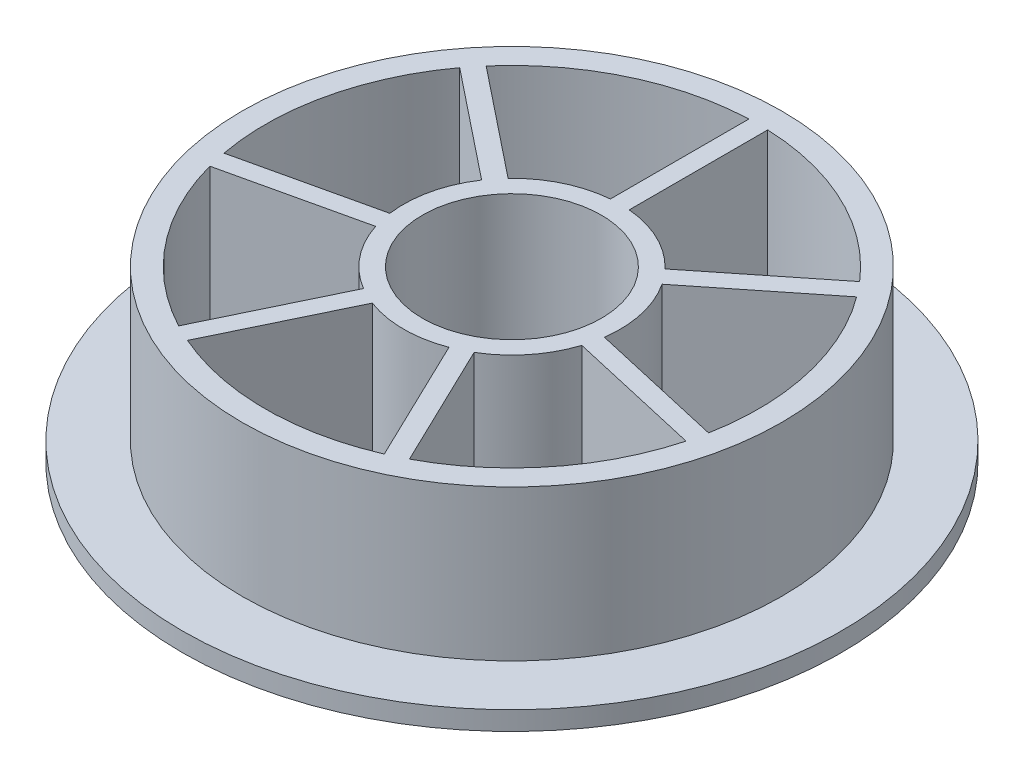
ISO-10303-21;
HEADER;
FILE_DESCRIPTION(('STEP AP214'),'2;1');
FILE_NAME('part.step','',(''),(''),'','','');
FILE_SCHEMA(('AUTOMOTIVE_DESIGN { 1 0 10303 214 1 1 1 1 }'));
ENDSEC;
DATA;
#1=APPLICATION_CONTEXT('core data for automotive mechanical design processes');
#2=APPLICATION_PROTOCOL_DEFINITION('international standard','automotive_design',2000,#1);
#3=PRODUCT_CONTEXT('',#1,'mechanical');
#4=PRODUCT('Part','Part','',(#3));
#5=PRODUCT_RELATED_PRODUCT_CATEGORY('part','',(#4));
#6=PRODUCT_DEFINITION_FORMATION('','',#4);
#7=PRODUCT_DEFINITION_CONTEXT('part definition',#1,'design');
#8=PRODUCT_DEFINITION('design','',#6,#7);
#9=PRODUCT_DEFINITION_SHAPE('','',#8);
#10=(LENGTH_UNIT() NAMED_UNIT(*) SI_UNIT(.MILLI.,.METRE.));
#11=(NAMED_UNIT(*) PLANE_ANGLE_UNIT() SI_UNIT($,.RADIAN.));
#12=(NAMED_UNIT(*) SI_UNIT($,.STERADIAN.) SOLID_ANGLE_UNIT());
#13=UNCERTAINTY_MEASURE_WITH_UNIT(LENGTH_MEASURE(1.E-05),#10,'distance_accuracy_value','');
#14=(GEOMETRIC_REPRESENTATION_CONTEXT(3) GLOBAL_UNCERTAINTY_ASSIGNED_CONTEXT((#13)) GLOBAL_UNIT_ASSIGNED_CONTEXT((#10,
#11,#12)) REPRESENTATION_CONTEXT('',''));
#15=CARTESIAN_POINT('',(0.,0.,0.));
#16=DIRECTION('',(0.,0.,1.));
#17=DIRECTION('',(1.,0.,0.));
#18=AXIS2_PLACEMENT_3D('',#15,#16,#17);
#19=CARTESIAN_POINT('',(0.,18.,0.));
#20=DIRECTION('',(0.,1.,0.));
#21=DIRECTION('',(0.,0.,1.));
#22=AXIS2_PLACEMENT_3D('',#19,#20,#21);
#23=PLANE('',#22);
#24=DIRECTION('',(0.433883739117558,0.,-0.900968867902419));
#25=VECTOR('',#24,1.);
#26=CARTESIAN_POINT('',(-12.2533879154767,18.,23.1396573160315));
#27=LINE('',#26,#25);
#28=CARTESIAN_POINT('',(-12.2533879154767,18.,23.1396573160315));
#29=VERTEX_POINT('',#28);
#30=CARTESIAN_POINT('',(-5.87173156119197,18.,9.88801135078748));
#31=VERTEX_POINT('',#30);
#32=EDGE_CURVE('E229',#29,#31,#27,.T.);
#33=ORIENTED_EDGE('',*,*,#32,.F.);
#34=CARTESIAN_POINT('',(0.,18.,0.));
#35=DIRECTION('',(0.,1.,0.));
#36=DIRECTION('',(0.,0.,1.));
#37=AXIS2_PLACEMENT_3D('',#34,#35,#36);
#38=CIRCLE('',#37,26.1837593960554);
#39=CARTESIAN_POINT('',(-25.2861331188013,18.,6.79711174020116));
#40=VERTEX_POINT('',#39);
#41=EDGE_CURVE('E221',#40,#29,#38,.T.);
#42=ORIENTED_EDGE('',*,*,#41,.F.);
#43=DIRECTION('',(-0.974927912181824,0.,0.222520933956315));
#44=VECTOR('',#43,1.);
#45=CARTESIAN_POINT('',(-25.2861331188013,18.,6.79711174020116));
#46=LINE('',#45,#44);
#47=CARTESIAN_POINT('',(-10.9466814527894,18.,3.52422547110097));
#48=VERTEX_POINT('',#47);
#49=EDGE_CURVE('E244',#48,#40,#46,.T.);
#50=ORIENTED_EDGE('',*,*,#49,.F.);
#51=CARTESIAN_POINT('',(0.,18.,0.));
#52=DIRECTION('',(0.,-1.,0.));
#53=DIRECTION('',(0.,0.,1.));
#54=AXIS2_PLACEMENT_3D('',#51,#52,#53);
#55=CIRCLE('',#54,11.5);
#56=EDGE_CURVE('E242',#31,#48,#55,.T.);
#57=ORIENTED_EDGE('',*,*,#56,.F.);
#58=EDGE_LOOP('',(#33,#42,#50,#57));
#59=FACE_BOUND('',#58,.T.);
#60=DIRECTION('',(-0.974927912181824,0.,-0.222520933956314));
#61=VECTOR('',#60,1.);
#62=CARTESIAN_POINT('',(25.2861331188022,18.,6.79711174019798));
#63=LINE('',#62,#61);
#64=CARTESIAN_POINT('',(25.2861331188022,18.,6.79711174019798));
#65=VERTEX_POINT('',#64);
#66=CARTESIAN_POINT('',(10.9466814527904,18.,3.52422547109784));
#67=VERTEX_POINT('',#66);
#68=EDGE_CURVE('E292',#65,#67,#63,.T.);
#69=ORIENTED_EDGE('',*,*,#68,.F.);
#70=CARTESIAN_POINT('',(0.,18.,0.));
#71=DIRECTION('',(0.,1.,0.));
#72=DIRECTION('',(0.,0.,1.));
#73=AXIS2_PLACEMENT_3D('',#70,#71,#72);
#74=CIRCLE('',#73,26.1837593960554);
#75=CARTESIAN_POINT('',(12.2533879154812,18.,23.1396573160291));
#76=VERTEX_POINT('',#75);
#77=EDGE_CURVE('E290',#76,#65,#74,.T.);
#78=ORIENTED_EDGE('',*,*,#77,.F.);
#79=DIRECTION('',(0.433883739117559,0.,0.900968867902419));
#80=VECTOR('',#79,1.);
#81=CARTESIAN_POINT('',(12.2533879154812,18.,23.1396573160291));
#82=LINE('',#81,#80);
#83=CARTESIAN_POINT('',(5.87173156119638,18.,9.88801135078487));
#84=VERTEX_POINT('',#83);
#85=EDGE_CURVE('E298',#84,#76,#82,.T.);
#86=ORIENTED_EDGE('',*,*,#85,.F.);
#87=CARTESIAN_POINT('',(0.,18.,0.));
#88=DIRECTION('',(0.,-1.,0.));
#89=DIRECTION('',(0.,0.,1.));
#90=AXIS2_PLACEMENT_3D('',#87,#88,#89);
#91=CIRCLE('',#90,11.5);
#92=EDGE_CURVE('E295',#67,#84,#91,.T.);
#93=ORIENTED_EDGE('',*,*,#92,.F.);
#94=EDGE_LOOP('',(#69,#78,#86,#93));
#95=FACE_BOUND('',#94,.T.);
#96=DIRECTION('',(0.78183148246803,0.,-0.623489801858734));
#97=VECTOR('',#96,1.);
#98=CARTESIAN_POINT('',(19.8328624726385,18.,-17.0952280549844));
#99=LINE('',#98,#97);
#100=CARTESIAN_POINT('',(8.33351507091407,18.,-7.92480451259513));
#101=VERTEX_POINT('',#100);
#102=CARTESIAN_POINT('',(19.8328624726385,18.,-17.0952280549844));
#103=VERTEX_POINT('',#102);
#104=EDGE_CURVE('E354',#101,#103,#99,.T.);
#105=ORIENTED_EDGE('',*,*,#104,.F.);
#106=CARTESIAN_POINT('',(0.,18.,0.));
#107=DIRECTION('',(0.,-1.,0.));
#108=DIRECTION('',(0.,0.,1.));
#109=AXIS2_PLACEMENT_3D('',#106,#107,#108);
#110=CIRCLE('',#109,11.5);
#111=CARTESIAN_POINT('',(0.999999999999998,18.,-11.4564392373896));
#112=VERTEX_POINT('',#111);
#113=EDGE_CURVE('E352',#112,#101,#110,.T.);
#114=ORIENTED_EDGE('',*,*,#113,.F.);
#115=DIRECTION('',(0.,0.,1.));
#116=VECTOR('',#115,1.);
#117=CARTESIAN_POINT('',(1.,18.,-26.1646566212997));
#118=LINE('',#117,#116);
#119=CARTESIAN_POINT('',(1.,18.,-26.1646566212997));
#120=VERTEX_POINT('',#119);
#121=EDGE_CURVE('E360',#120,#112,#118,.T.);
#122=ORIENTED_EDGE('',*,*,#121,.F.);
#123=CARTESIAN_POINT('',(0.,18.,0.));
#124=DIRECTION('',(0.,1.,0.));
#125=DIRECTION('',(0.,0.,1.));
#126=AXIS2_PLACEMENT_3D('',#123,#124,#125);
#127=CIRCLE('',#126,26.1837593960554);
#128=EDGE_CURVE('E357',#103,#120,#127,.T.);
#129=ORIENTED_EDGE('',*,*,#128,.F.);
#130=EDGE_LOOP('',(#105,#114,#122,#129));
#131=FACE_BOUND('',#130,.T.);
#132=DIRECTION('',(0.78183148246803,0.,0.623489801858733));
#133=VECTOR('',#132,1.);
#134=CARTESIAN_POINT('',(-19.8328624726392,18.,-17.0952280549837));
#135=LINE('',#134,#133);
#136=CARTESIAN_POINT('',(-19.8328624726392,18.,-17.0952280549837));
#137=VERTEX_POINT('',#136);
#138=CARTESIAN_POINT('',(-8.33351507091476,18.,-7.9248045125944));
#139=VERTEX_POINT('',#138);
#140=EDGE_CURVE('E416',#137,#139,#135,.T.);
#141=ORIENTED_EDGE('',*,*,#140,.F.);
#142=CARTESIAN_POINT('',(0.,18.,0.));
#143=DIRECTION('',(0.,1.,0.));
#144=DIRECTION('',(0.,0.,1.));
#145=AXIS2_PLACEMENT_3D('',#142,#143,#144);
#146=CIRCLE('',#145,26.1837593960554);
#147=CARTESIAN_POINT('',(-1.,18.,-26.1646566212997));
#148=VERTEX_POINT('',#147);
#149=EDGE_CURVE('E414',#148,#137,#146,.T.);
#150=ORIENTED_EDGE('',*,*,#149,.F.);
#151=DIRECTION('',(0.,0.,-1.));
#152=VECTOR('',#151,1.);
#153=CARTESIAN_POINT('',(-1.,18.,-26.1646566212997));
#154=LINE('',#153,#152);
#155=CARTESIAN_POINT('',(-0.999999999999998,18.,-11.4564392373896));
#156=VERTEX_POINT('',#155);
#157=EDGE_CURVE('E422',#156,#148,#154,.T.);
#158=ORIENTED_EDGE('',*,*,#157,.F.);
#159=CARTESIAN_POINT('',(0.,18.,0.));
#160=DIRECTION('',(0.,-1.,0.));
#161=DIRECTION('',(0.,0.,1.));
#162=AXIS2_PLACEMENT_3D('',#159,#160,#161);
#163=CIRCLE('',#162,11.5);
#164=EDGE_CURVE('E419',#139,#156,#163,.T.);
#165=ORIENTED_EDGE('',*,*,#164,.F.);
#166=EDGE_LOOP('',(#141,#150,#158,#165));
#167=FACE_BOUND('',#166,.T.);
#168=CARTESIAN_POINT('',(0.,18.,0.));
#169=DIRECTION('',(0.,1.,0.));
#170=DIRECTION('',(0.,0.,1.));
#171=AXIS2_PLACEMENT_3D('',#168,#169,#170);
#172=CIRCLE('',#171,9.5);
#173=CARTESIAN_POINT('',(0.,18.,9.5));
#174=VERTEX_POINT('',#173);
#175=EDGE_CURVE('E44',#174,#174,#172,.T.);
#176=ORIENTED_EDGE('',*,*,#175,.F.);
#177=EDGE_LOOP('',(#176));
#178=FACE_BOUND('',#177,.T.);
#179=DIRECTION('',(-0.78183148246803,0.,0.623489801858734));
#180=VECTOR('',#179,1.);
#181=CARTESIAN_POINT('',(21.079842076356,18.,-15.5315650900484));
#182=LINE('',#181,#180);
#183=CARTESIAN_POINT('',(21.079842076356,18.,-15.5315650900484));
#184=VERTEX_POINT('',#183);
#185=CARTESIAN_POINT('',(9.58049467463162,18.,-6.36114154765914));
#186=VERTEX_POINT('',#185);
#187=EDGE_CURVE('E385',#184,#186,#182,.T.);
#188=ORIENTED_EDGE('',*,*,#187,.F.);
#189=CARTESIAN_POINT('',(0.,18.,0.));
#190=DIRECTION('',(0.,1.,0.));
#191=DIRECTION('',(0.,0.,1.));
#192=AXIS2_PLACEMENT_3D('',#189,#190,#191);
#193=CIRCLE('',#192,26.1837593960554);
#194=CARTESIAN_POINT('',(25.7311749867147,18.,4.84725591583431));
#195=VERTEX_POINT('',#194);
#196=EDGE_CURVE('E383',#195,#184,#193,.T.);
#197=ORIENTED_EDGE('',*,*,#196,.F.);
#198=DIRECTION('',(0.974927912181824,0.,0.222520933956314));
#199=VECTOR('',#198,1.);
#200=CARTESIAN_POINT('',(25.7311749867147,18.,4.84725591583431));
#201=LINE('',#200,#199);
#202=CARTESIAN_POINT('',(11.3917233207027,18.,1.57436964673412));
#203=VERTEX_POINT('',#202);
#204=EDGE_CURVE('E391',#203,#195,#201,.T.);
#205=ORIENTED_EDGE('',*,*,#204,.F.);
#206=CARTESIAN_POINT('',(0.,18.,0.));
#207=DIRECTION('',(0.,-1.,0.));
#208=DIRECTION('',(0.,0.,1.));
#209=AXIS2_PLACEMENT_3D('',#206,#207,#208);
#210=CIRCLE('',#209,11.5);
#211=EDGE_CURVE('E388',#186,#203,#210,.T.);
#212=ORIENTED_EDGE('',*,*,#211,.F.);
#213=EDGE_LOOP('',(#188,#197,#205,#212));
#214=FACE_BOUND('',#213,.T.);
#215=DIRECTION('',(0.974927912181824,0.,-0.222520933956315));
#216=VECTOR('',#215,1.);
#217=CARTESIAN_POINT('',(-25.731174986714,18.,4.84725591583754));
#218=LINE('',#217,#216);
#219=CARTESIAN_POINT('',(-25.731174986714,18.,4.84725591583754));
#220=VERTEX_POINT('',#219);
#221=CARTESIAN_POINT('',(-11.3917233207023,18.,1.57436964673739));
#222=VERTEX_POINT('',#221);
#223=EDGE_CURVE('E323',#220,#222,#218,.T.);
#224=ORIENTED_EDGE('',*,*,#223,.F.);
#225=CARTESIAN_POINT('',(0.,18.,0.));
#226=DIRECTION('',(0.,1.,0.));
#227=DIRECTION('',(0.,0.,1.));
#228=AXIS2_PLACEMENT_3D('',#225,#226,#227);
#229=CIRCLE('',#228,26.1837593960554);
#230=CARTESIAN_POINT('',(-21.0798420763567,18.,-15.5315650900476));
#231=VERTEX_POINT('',#230);
#232=EDGE_CURVE('E321',#231,#220,#229,.T.);
#233=ORIENTED_EDGE('',*,*,#232,.F.);
#234=DIRECTION('',(-0.78183148246803,0.,-0.623489801858733));
#235=VECTOR('',#234,1.);
#236=CARTESIAN_POINT('',(-21.0798420763567,18.,-15.5315650900476));
#237=LINE('',#236,#235);
#238=CARTESIAN_POINT('',(-9.58049467463218,18.,-6.36114154765829));
#239=VERTEX_POINT('',#238);
#240=EDGE_CURVE('E329',#239,#231,#237,.T.);
#241=ORIENTED_EDGE('',*,*,#240,.F.);
#242=CARTESIAN_POINT('',(0.,18.,0.));
#243=DIRECTION('',(0.,-1.,0.));
#244=DIRECTION('',(0.,0.,1.));
#245=AXIS2_PLACEMENT_3D('',#242,#243,#244);
#246=CIRCLE('',#245,11.5);
#247=EDGE_CURVE('E326',#222,#239,#246,.T.);
#248=ORIENTED_EDGE('',*,*,#247,.F.);
#249=EDGE_LOOP('',(#224,#233,#241,#248));
#250=FACE_BOUND('',#249,.T.);
#251=DIRECTION('',(-0.433883739117558,0.,-0.900968867902419));
#252=VECTOR('',#251,1.);
#253=CARTESIAN_POINT('',(10.4514501796765,18.,24.0074247942644));
#254=LINE('',#253,#252);
#255=CARTESIAN_POINT('',(10.4514501796765,18.,24.0074247942644));
#256=VERTEX_POINT('',#255);
#257=CARTESIAN_POINT('',(4.06979382539173,18.,10.7557788290204));
#258=VERTEX_POINT('',#257);
#259=EDGE_CURVE('E261',#256,#258,#254,.T.);
#260=ORIENTED_EDGE('',*,*,#259,.F.);
#261=CARTESIAN_POINT('',(0.,18.,0.));
#262=DIRECTION('',(0.,1.,0.));
#263=DIRECTION('',(0.,0.,1.));
#264=AXIS2_PLACEMENT_3D('',#261,#262,#263);
#265=CIRCLE('',#264,26.1837593960554);
#266=CARTESIAN_POINT('',(-10.4514501796718,18.,24.0074247942665));
#267=VERTEX_POINT('',#266);
#268=EDGE_CURVE('E259',#267,#256,#265,.T.);
#269=ORIENTED_EDGE('',*,*,#268,.F.);
#270=DIRECTION('',(-0.433883739117558,0.,0.900968867902419));
#271=VECTOR('',#270,1.);
#272=CARTESIAN_POINT('',(-10.4514501796718,18.,24.0074247942665));
#273=LINE('',#272,#271);
#274=CARTESIAN_POINT('',(-4.06979382538694,18.,10.7557788290222));
#275=VERTEX_POINT('',#274);
#276=EDGE_CURVE('E267',#275,#267,#273,.T.);
#277=ORIENTED_EDGE('',*,*,#276,.F.);
#278=CARTESIAN_POINT('',(0.,18.,0.));
#279=DIRECTION('',(0.,-1.,0.));
#280=DIRECTION('',(0.,0.,1.));
#281=AXIS2_PLACEMENT_3D('',#278,#279,#280);
#282=CIRCLE('',#281,11.5);
#283=EDGE_CURVE('E264',#258,#275,#282,.T.);
#284=ORIENTED_EDGE('',*,*,#283,.F.);
#285=EDGE_LOOP('',(#260,#269,#277,#284));
#286=FACE_BOUND('',#285,.T.);
#287=CARTESIAN_POINT('',(0.,18.,0.));
#288=DIRECTION('',(0.,1.,0.));
#289=DIRECTION('',(0.,0.,1.));
#290=AXIS2_PLACEMENT_3D('',#287,#288,#289);
#291=CIRCLE('',#290,28.6507379536552);
#292=CARTESIAN_POINT('',(0.,18.,28.6507379536552));
#293=VERTEX_POINT('',#292);
#294=EDGE_CURVE('E481',#293,#293,#291,.T.);
#295=ORIENTED_EDGE('',*,*,#294,.T.);
#296=EDGE_LOOP('',(#295));
#297=FACE_BOUND('',#296,.T.);
#298=ADVANCED_FACE('F35',(#59,#95,#131,#167,#178,#214,#250,#286,#297),#23,.T.);
#299=CARTESIAN_POINT('',(0.,18.,0.));
#300=DIRECTION('',(0.,-1.,0.));
#301=DIRECTION('',(0.,0.,-1.));
#302=AXIS2_PLACEMENT_3D('',#299,#300,#301);
#303=CYLINDRICAL_SURFACE('',#302,35.);
#304=CARTESIAN_POINT('',(0.,0.,0.));
#305=DIRECTION('',(0.,1.,0.));
#306=DIRECTION('',(0.,0.,1.));
#307=AXIS2_PLACEMENT_3D('',#304,#305,#306);
#308=CIRCLE('',#307,35.);
#309=CARTESIAN_POINT('',(0.,0.,35.));
#310=VERTEX_POINT('',#309);
#311=EDGE_CURVE('E11',#310,#310,#308,.T.);
#312=ORIENTED_EDGE('',*,*,#311,.T.);
#313=EDGE_LOOP('',(#312));
#314=FACE_BOUND('',#313,.T.);
#315=CARTESIAN_POINT('',(0.,2.,0.));
#316=DIRECTION('',(0.,1.,0.));
#317=DIRECTION('',(0.,0.,1.));
#318=AXIS2_PLACEMENT_3D('',#315,#316,#317);
#319=CIRCLE('',#318,35.);
#320=CARTESIAN_POINT('',(0.,2.,35.));
#321=VERTEX_POINT('',#320);
#322=EDGE_CURVE('E39',#321,#321,#319,.T.);
#323=ORIENTED_EDGE('',*,*,#322,.F.);
#324=EDGE_LOOP('',(#323));
#325=FACE_BOUND('',#324,.T.);
#326=ADVANCED_FACE('F37',(#314,#325),#303,.T.);
#327=CARTESIAN_POINT('',(0.,0.,0.));
#328=DIRECTION('',(0.,1.,0.));
#329=DIRECTION('',(0.,0.,1.));
#330=AXIS2_PLACEMENT_3D('',#327,#328,#329);
#331=PLANE('',#330);
#332=CARTESIAN_POINT('',(0.,0.,0.));
#333=DIRECTION('',(0.,1.,0.));
#334=DIRECTION('',(0.,0.,1.));
#335=AXIS2_PLACEMENT_3D('',#332,#333,#334);
#336=CIRCLE('',#335,26.1837593960554);
#337=CARTESIAN_POINT('',(-10.4514501796718,0.,24.0074247942665));
#338=VERTEX_POINT('',#337);
#339=CARTESIAN_POINT('',(10.4514501796765,0.,24.0074247942644));
#340=VERTEX_POINT('',#339);
#341=EDGE_CURVE('E237',#338,#340,#336,.T.);
#342=ORIENTED_EDGE('',*,*,#341,.T.);
#343=DIRECTION('',(-0.433883739117558,0.,-0.900968867902419));
#344=VECTOR('',#343,1.);
#345=CARTESIAN_POINT('',(10.4514501796765,0.,24.0074247942644));
#346=LINE('',#345,#344);
#347=CARTESIAN_POINT('',(4.06979382539173,0.,10.7557788290204));
#348=VERTEX_POINT('',#347);
#349=EDGE_CURVE('E272',#340,#348,#346,.T.);
#350=ORIENTED_EDGE('',*,*,#349,.T.);
#351=CARTESIAN_POINT('',(0.,0.,0.));
#352=DIRECTION('',(0.,-1.,0.));
#353=DIRECTION('',(0.,0.,1.));
#354=AXIS2_PLACEMENT_3D('',#351,#352,#353);
#355=CIRCLE('',#354,11.5);
#356=CARTESIAN_POINT('',(-4.06979382538695,0.,10.7557788290222));
#357=VERTEX_POINT('',#356);
#358=EDGE_CURVE('E275',#348,#357,#355,.T.);
#359=ORIENTED_EDGE('',*,*,#358,.T.);
#360=DIRECTION('',(-0.433883739117558,0.,0.900968867902419));
#361=VECTOR('',#360,1.);
#362=CARTESIAN_POINT('',(-10.4514501796718,0.,24.0074247942665));
#363=LINE('',#362,#361);
#364=EDGE_CURVE('E262',#357,#338,#363,.T.);
#365=ORIENTED_EDGE('',*,*,#364,.T.);
#366=EDGE_LOOP('',(#342,#350,#359,#365));
#367=FACE_BOUND('',#366,.T.);
#368=CARTESIAN_POINT('',(0.,0.,0.));
#369=DIRECTION('',(0.,1.,0.));
#370=DIRECTION('',(0.,0.,1.));
#371=AXIS2_PLACEMENT_3D('',#368,#369,#370);
#372=CIRCLE('',#371,26.1837593960554);
#373=CARTESIAN_POINT('',(-21.0798420763567,0.,-15.5315650900476));
#374=VERTEX_POINT('',#373);
#375=CARTESIAN_POINT('',(-25.731174986714,0.,4.84725591583754));
#376=VERTEX_POINT('',#375);
#377=EDGE_CURVE('E320',#374,#376,#372,.T.);
#378=ORIENTED_EDGE('',*,*,#377,.T.);
#379=DIRECTION('',(0.974927912181824,0.,-0.222520933956315));
#380=VECTOR('',#379,1.);
#381=CARTESIAN_POINT('',(-25.731174986714,0.,4.84725591583754));
#382=LINE('',#381,#380);
#383=CARTESIAN_POINT('',(-11.3917233207023,0.,1.57436964673739));
#384=VERTEX_POINT('',#383);
#385=EDGE_CURVE('E334',#376,#384,#382,.T.);
#386=ORIENTED_EDGE('',*,*,#385,.T.);
#387=CARTESIAN_POINT('',(0.,0.,0.));
#388=DIRECTION('',(0.,-1.,0.));
#389=DIRECTION('',(0.,0.,1.));
#390=AXIS2_PLACEMENT_3D('',#387,#388,#389);
#391=CIRCLE('',#390,11.5);
#392=CARTESIAN_POINT('',(-9.58049467463218,0.,-6.36114154765829));
#393=VERTEX_POINT('',#392);
#394=EDGE_CURVE('E337',#384,#393,#391,.T.);
#395=ORIENTED_EDGE('',*,*,#394,.T.);
#396=DIRECTION('',(-0.78183148246803,0.,-0.623489801858733));
#397=VECTOR('',#396,1.);
#398=CARTESIAN_POINT('',(-21.0798420763567,0.,-15.5315650900476));
#399=LINE('',#398,#397);
#400=EDGE_CURVE('E324',#393,#374,#399,.T.);
#401=ORIENTED_EDGE('',*,*,#400,.T.);
#402=EDGE_LOOP('',(#378,#386,#395,#401));
#403=FACE_BOUND('',#402,.T.);
#404=CARTESIAN_POINT('',(0.,0.,0.));
#405=DIRECTION('',(0.,1.,0.));
#406=DIRECTION('',(0.,0.,1.));
#407=AXIS2_PLACEMENT_3D('',#404,#405,#406);
#408=CIRCLE('',#407,26.1837593960554);
#409=CARTESIAN_POINT('',(25.7311749867147,0.,4.84725591583431));
#410=VERTEX_POINT('',#409);
#411=CARTESIAN_POINT('',(21.079842076356,0.,-15.5315650900484));
#412=VERTEX_POINT('',#411);
#413=EDGE_CURVE('E382',#410,#412,#408,.T.);
#414=ORIENTED_EDGE('',*,*,#413,.T.);
#415=DIRECTION('',(-0.78183148246803,0.,0.623489801858734));
#416=VECTOR('',#415,1.);
#417=CARTESIAN_POINT('',(21.079842076356,0.,-15.5315650900484));
#418=LINE('',#417,#416);
#419=CARTESIAN_POINT('',(9.58049467463162,0.,-6.36114154765914));
#420=VERTEX_POINT('',#419);
#421=EDGE_CURVE('E396',#412,#420,#418,.T.);
#422=ORIENTED_EDGE('',*,*,#421,.T.);
#423=CARTESIAN_POINT('',(0.,0.,0.));
#424=DIRECTION('',(0.,-1.,0.));
#425=DIRECTION('',(0.,0.,1.));
#426=AXIS2_PLACEMENT_3D('',#423,#424,#425);
#427=CIRCLE('',#426,11.5);
#428=CARTESIAN_POINT('',(11.3917233207027,0.,1.57436964673412));
#429=VERTEX_POINT('',#428);
#430=EDGE_CURVE('E399',#420,#429,#427,.T.);
#431=ORIENTED_EDGE('',*,*,#430,.T.);
#432=DIRECTION('',(0.974927912181824,0.,0.222520933956314));
#433=VECTOR('',#432,1.);
#434=CARTESIAN_POINT('',(25.7311749867147,0.,4.84725591583431));
#435=LINE('',#434,#433);
#436=EDGE_CURVE('E386',#429,#410,#435,.T.);
#437=ORIENTED_EDGE('',*,*,#436,.T.);
#438=EDGE_LOOP('',(#414,#422,#431,#437));
#439=FACE_BOUND('',#438,.T.);
#440=CARTESIAN_POINT('',(0.,0.,0.));
#441=DIRECTION('',(0.,1.,0.));
#442=DIRECTION('',(0.,0.,1.));
#443=AXIS2_PLACEMENT_3D('',#440,#441,#442);
#444=CIRCLE('',#443,9.5);
#445=CARTESIAN_POINT('',(0.,0.,9.5));
#446=VERTEX_POINT('',#445);
#447=EDGE_CURVE('E444',#446,#446,#444,.T.);
#448=ORIENTED_EDGE('',*,*,#447,.T.);
#449=EDGE_LOOP('',(#448));
#450=FACE_BOUND('',#449,.T.);
#451=ORIENTED_EDGE('',*,*,#311,.F.);
#452=EDGE_LOOP('',(#451));
#453=FACE_BOUND('',#452,.T.);
#454=CARTESIAN_POINT('',(0.,0.,0.));
#455=DIRECTION('',(0.,1.,0.));
#456=DIRECTION('',(0.,0.,1.));
#457=AXIS2_PLACEMENT_3D('',#454,#455,#456);
#458=CIRCLE('',#457,26.1837593960554);
#459=CARTESIAN_POINT('',(-1.,0.,-26.1646566212997));
#460=VERTEX_POINT('',#459);
#461=CARTESIAN_POINT('',(-19.8328624726392,0.,-17.0952280549837));
#462=VERTEX_POINT('',#461);
#463=EDGE_CURVE('E413',#460,#462,#458,.T.);
#464=ORIENTED_EDGE('',*,*,#463,.T.);
#465=DIRECTION('',(0.78183148246803,0.,0.623489801858733));
#466=VECTOR('',#465,1.);
#467=CARTESIAN_POINT('',(-19.8328624726392,0.,-17.0952280549837));
#468=LINE('',#467,#466);
#469=CARTESIAN_POINT('',(-8.33351507091476,0.,-7.9248045125944));
#470=VERTEX_POINT('',#469);
#471=EDGE_CURVE('E427',#462,#470,#468,.T.);
#472=ORIENTED_EDGE('',*,*,#471,.T.);
#473=CARTESIAN_POINT('',(0.,0.,0.));
#474=DIRECTION('',(0.,-1.,0.));
#475=DIRECTION('',(0.,0.,1.));
#476=AXIS2_PLACEMENT_3D('',#473,#474,#475);
#477=CIRCLE('',#476,11.5);
#478=CARTESIAN_POINT('',(-0.999999999999998,0.,-11.4564392373896));
#479=VERTEX_POINT('',#478);
#480=EDGE_CURVE('E430',#470,#479,#477,.T.);
#481=ORIENTED_EDGE('',*,*,#480,.T.);
#482=DIRECTION('',(0.,0.,-1.));
#483=VECTOR('',#482,1.);
#484=CARTESIAN_POINT('',(-1.,0.,-26.1646566212997));
#485=LINE('',#484,#483);
#486=EDGE_CURVE('E417',#479,#460,#485,.T.);
#487=ORIENTED_EDGE('',*,*,#486,.T.);
#488=EDGE_LOOP('',(#464,#472,#481,#487));
#489=FACE_BOUND('',#488,.T.);
#490=CARTESIAN_POINT('',(0.,0.,0.));
#491=DIRECTION('',(0.,-1.,0.));
#492=DIRECTION('',(0.,0.,1.));
#493=AXIS2_PLACEMENT_3D('',#490,#491,#492);
#494=CIRCLE('',#493,11.5);
#495=CARTESIAN_POINT('',(0.999999999999998,0.,-11.4564392373896));
#496=VERTEX_POINT('',#495);
#497=CARTESIAN_POINT('',(8.33351507091407,0.,-7.92480451259513));
#498=VERTEX_POINT('',#497);
#499=EDGE_CURVE('E351',#496,#498,#494,.T.);
#500=ORIENTED_EDGE('',*,*,#499,.T.);
#501=DIRECTION('',(0.78183148246803,0.,-0.623489801858734));
#502=VECTOR('',#501,1.);
#503=CARTESIAN_POINT('',(19.8328624726385,0.,-17.0952280549844));
#504=LINE('',#503,#502);
#505=CARTESIAN_POINT('',(19.8328624726385,0.,-17.0952280549844));
#506=VERTEX_POINT('',#505);
#507=EDGE_CURVE('E365',#498,#506,#504,.T.);
#508=ORIENTED_EDGE('',*,*,#507,.T.);
#509=CARTESIAN_POINT('',(0.,0.,0.));
#510=DIRECTION('',(0.,1.,0.));
#511=DIRECTION('',(0.,0.,1.));
#512=AXIS2_PLACEMENT_3D('',#509,#510,#511);
#513=CIRCLE('',#512,26.1837593960554);
#514=CARTESIAN_POINT('',(1.00000000000001,0.,-26.1646566212997));
#515=VERTEX_POINT('',#514);
#516=EDGE_CURVE('E368',#506,#515,#513,.T.);
#517=ORIENTED_EDGE('',*,*,#516,.T.);
#518=DIRECTION('',(0.,0.,1.));
#519=VECTOR('',#518,1.);
#520=CARTESIAN_POINT('',(1.,0.,-26.1646566212997));
#521=LINE('',#520,#519);
#522=EDGE_CURVE('E355',#515,#496,#521,.T.);
#523=ORIENTED_EDGE('',*,*,#522,.T.);
#524=EDGE_LOOP('',(#500,#508,#517,#523));
#525=FACE_BOUND('',#524,.T.);
#526=CARTESIAN_POINT('',(0.,0.,0.));
#527=DIRECTION('',(0.,1.,0.));
#528=DIRECTION('',(0.,0.,1.));
#529=AXIS2_PLACEMENT_3D('',#526,#527,#528);
#530=CIRCLE('',#529,26.1837593960554);
#531=CARTESIAN_POINT('',(12.2533879154812,0.,23.1396573160291));
#532=VERTEX_POINT('',#531);
#533=CARTESIAN_POINT('',(25.2861331188022,0.,6.79711174019798));
#534=VERTEX_POINT('',#533);
#535=EDGE_CURVE('E289',#532,#534,#530,.T.);
#536=ORIENTED_EDGE('',*,*,#535,.T.);
#537=DIRECTION('',(-0.974927912181824,0.,-0.222520933956314));
#538=VECTOR('',#537,1.);
#539=CARTESIAN_POINT('',(25.2861331188022,0.,6.79711174019798));
#540=LINE('',#539,#538);
#541=CARTESIAN_POINT('',(10.9466814527904,0.,3.52422547109784));
#542=VERTEX_POINT('',#541);
#543=EDGE_CURVE('E303',#534,#542,#540,.T.);
#544=ORIENTED_EDGE('',*,*,#543,.T.);
#545=CARTESIAN_POINT('',(0.,0.,0.));
#546=DIRECTION('',(0.,-1.,0.));
#547=DIRECTION('',(0.,0.,1.));
#548=AXIS2_PLACEMENT_3D('',#545,#546,#547);
#549=CIRCLE('',#548,11.5);
#550=CARTESIAN_POINT('',(5.87173156119638,0.,9.88801135078487));
#551=VERTEX_POINT('',#550);
#552=EDGE_CURVE('E306',#542,#551,#549,.T.);
#553=ORIENTED_EDGE('',*,*,#552,.T.);
#554=DIRECTION('',(0.433883739117559,0.,0.900968867902419));
#555=VECTOR('',#554,1.);
#556=CARTESIAN_POINT('',(12.2533879154812,0.,23.1396573160291));
#557=LINE('',#556,#555);
#558=EDGE_CURVE('E293',#551,#532,#557,.T.);
#559=ORIENTED_EDGE('',*,*,#558,.T.);
#560=EDGE_LOOP('',(#536,#544,#553,#559));
#561=FACE_BOUND('',#560,.T.);
#562=CARTESIAN_POINT('',(0.,0.,0.));
#563=DIRECTION('',(0.,1.,0.));
#564=DIRECTION('',(0.,0.,1.));
#565=AXIS2_PLACEMENT_3D('',#562,#563,#564);
#566=CIRCLE('',#565,26.1837593960554);
#567=CARTESIAN_POINT('',(-25.2861331188013,0.,6.79711174020116));
#568=VERTEX_POINT('',#567);
#569=CARTESIAN_POINT('',(-12.2533879154767,0.,23.1396573160315));
#570=VERTEX_POINT('',#569);
#571=EDGE_CURVE('E59',#568,#570,#566,.T.);
#572=ORIENTED_EDGE('',*,*,#571,.T.);
#573=DIRECTION('',(0.433883739117558,0.,-0.900968867902419));
#574=VECTOR('',#573,1.);
#575=CARTESIAN_POINT('',(-12.2533879154767,0.,23.1396573160315));
#576=LINE('',#575,#574);
#577=CARTESIAN_POINT('',(-5.87173156119197,0.,9.88801135078748));
#578=VERTEX_POINT('',#577);
#579=EDGE_CURVE('E236',#570,#578,#576,.T.);
#580=ORIENTED_EDGE('',*,*,#579,.T.);
#581=CARTESIAN_POINT('',(0.,0.,0.));
#582=DIRECTION('',(0.,-1.,0.));
#583=DIRECTION('',(0.,0.,1.));
#584=AXIS2_PLACEMENT_3D('',#581,#582,#583);
#585=CIRCLE('',#584,11.5);
#586=CARTESIAN_POINT('',(-10.9466814527894,0.,3.52422547110097));
#587=VERTEX_POINT('',#586);
#588=EDGE_CURVE('E251',#578,#587,#585,.T.);
#589=ORIENTED_EDGE('',*,*,#588,.T.);
#590=DIRECTION('',(-0.974927912181824,0.,0.222520933956315));
#591=VECTOR('',#590,1.);
#592=CARTESIAN_POINT('',(-25.2861331188013,0.,6.79711174020116));
#593=LINE('',#592,#591);
#594=EDGE_CURVE('E230',#587,#568,#593,.T.);
#595=ORIENTED_EDGE('',*,*,#594,.T.);
#596=EDGE_LOOP('',(#572,#580,#589,#595));
#597=FACE_BOUND('',#596,.T.);
#598=ADVANCED_FACE('F450',(#367,#403,#439,#450,#453,#489,#525,#561,#597),#331,.F.);
#599=CARTESIAN_POINT('',(0.,18.,0.));
#600=DIRECTION('',(0.,-1.,0.));
#601=DIRECTION('',(0.,0.,-1.));
#602=AXIS2_PLACEMENT_3D('',#599,#600,#601);
#603=CYLINDRICAL_SURFACE('',#602,9.5);
#604=ORIENTED_EDGE('',*,*,#175,.T.);
#605=EDGE_LOOP('',(#604));
#606=FACE_BOUND('',#605,.T.);
#607=ORIENTED_EDGE('',*,*,#447,.F.);
#608=EDGE_LOOP('',(#607));
#609=FACE_BOUND('',#608,.T.);
#610=ADVANCED_FACE('F453',(#606,#609),#603,.F.);
#611=CARTESIAN_POINT('',(0.,18.,0.));
#612=DIRECTION('',(0.,-1.,0.));
#613=DIRECTION('',(0.,0.,-1.));
#614=AXIS2_PLACEMENT_3D('',#611,#612,#613);
#615=CYLINDRICAL_SURFACE('',#614,26.1837593960554);
#616=ORIENTED_EDGE('',*,*,#463,.F.);
#617=DIRECTION('',(0.,-1.,0.));
#618=VECTOR('',#617,1.);
#619=CARTESIAN_POINT('',(-1.,18.,-26.1646566212997));
#620=LINE('',#619,#618);
#621=EDGE_CURVE('E424',#148,#460,#620,.T.);
#622=ORIENTED_EDGE('',*,*,#621,.F.);
#623=ORIENTED_EDGE('',*,*,#149,.T.);
#624=DIRECTION('',(0.,-1.,0.));
#625=VECTOR('',#624,1.);
#626=CARTESIAN_POINT('',(-19.8328624726392,18.,-17.0952280549837));
#627=LINE('',#626,#625);
#628=EDGE_CURVE('E441',#137,#462,#627,.T.);
#629=ORIENTED_EDGE('',*,*,#628,.T.);
#630=EDGE_LOOP('',(#616,#622,#623,#629));
#631=FACE_BOUND('',#630,.T.);
#632=ADVANCED_FACE('F455',(#631),#615,.F.);
#633=CARTESIAN_POINT('',(-19.8328624726392,18.,-17.0952280549837));
#634=DIRECTION('',(0.623489801858733,0.,-0.78183148246803));
#635=DIRECTION('',(-0.78183148246803,0.,-0.623489801858734));
#636=AXIS2_PLACEMENT_3D('',#633,#634,#635);
#637=PLANE('',#636);
#638=ORIENTED_EDGE('',*,*,#471,.F.);
#639=ORIENTED_EDGE('',*,*,#628,.F.);
#640=ORIENTED_EDGE('',*,*,#140,.T.);
#641=DIRECTION('',(0.,-1.,0.));
#642=VECTOR('',#641,1.);
#643=CARTESIAN_POINT('',(-8.33351507091476,18.,-7.9248045125944));
#644=LINE('',#643,#642);
#645=EDGE_CURVE('E439',#139,#470,#644,.T.);
#646=ORIENTED_EDGE('',*,*,#645,.T.);
#647=EDGE_LOOP('',(#638,#639,#640,#646));
#648=FACE_BOUND('',#647,.T.);
#649=ADVANCED_FACE('F462',(#648),#637,.T.);
#650=CARTESIAN_POINT('',(0.,18.,0.));
#651=DIRECTION('',(0.,-1.,0.));
#652=DIRECTION('',(0.,0.,-1.));
#653=AXIS2_PLACEMENT_3D('',#650,#651,#652);
#654=CYLINDRICAL_SURFACE('',#653,11.5);
#655=ORIENTED_EDGE('',*,*,#480,.F.);
#656=ORIENTED_EDGE('',*,*,#645,.F.);
#657=ORIENTED_EDGE('',*,*,#164,.T.);
#658=DIRECTION('',(0.,-1.,0.));
#659=VECTOR('',#658,1.);
#660=CARTESIAN_POINT('',(-0.999999999999998,18.,-11.4564392373896));
#661=LINE('',#660,#659);
#662=EDGE_CURVE('E437',#156,#479,#661,.T.);
#663=ORIENTED_EDGE('',*,*,#662,.T.);
#664=EDGE_LOOP('',(#655,#656,#657,#663));
#665=FACE_BOUND('',#664,.T.);
#666=ADVANCED_FACE('F593',(#665),#654,.T.);
#667=CARTESIAN_POINT('',(-1.,18.,-26.1646566212997));
#668=DIRECTION('',(-1.,0.,0.));
#669=DIRECTION('',(0.,0.,1.));
#670=AXIS2_PLACEMENT_3D('',#667,#668,#669);
#671=PLANE('',#670);
#672=ORIENTED_EDGE('',*,*,#486,.F.);
#673=ORIENTED_EDGE('',*,*,#662,.F.);
#674=ORIENTED_EDGE('',*,*,#157,.T.);
#675=ORIENTED_EDGE('',*,*,#621,.T.);
#676=EDGE_LOOP('',(#672,#673,#674,#675));
#677=FACE_BOUND('',#676,.T.);
#678=ADVANCED_FACE('F589',(#677),#671,.T.);
#679=CARTESIAN_POINT('',(0.,18.,0.));
#680=DIRECTION('',(0.,-1.,0.));
#681=DIRECTION('',(0.,0.,-1.));
#682=AXIS2_PLACEMENT_3D('',#679,#680,#681);
#683=CYLINDRICAL_SURFACE('',#682,26.1837593960554);
#684=ORIENTED_EDGE('',*,*,#413,.F.);
#685=DIRECTION('',(0.,-1.,0.));
#686=VECTOR('',#685,1.);
#687=CARTESIAN_POINT('',(25.7311749867147,18.,4.84725591583431));
#688=LINE('',#687,#686);
#689=EDGE_CURVE('E393',#195,#410,#688,.T.);
#690=ORIENTED_EDGE('',*,*,#689,.F.);
#691=ORIENTED_EDGE('',*,*,#196,.T.);
#692=DIRECTION('',(0.,-1.,0.));
#693=VECTOR('',#692,1.);
#694=CARTESIAN_POINT('',(21.079842076356,18.,-15.5315650900484));
#695=LINE('',#694,#693);
#696=EDGE_CURVE('E410',#184,#412,#695,.T.);
#697=ORIENTED_EDGE('',*,*,#696,.T.);
#698=EDGE_LOOP('',(#684,#690,#691,#697));
#699=FACE_BOUND('',#698,.T.);
#700=ADVANCED_FACE('F585',(#699),#683,.F.);
#701=CARTESIAN_POINT('',(21.079842076356,18.,-15.5315650900484));
#702=DIRECTION('',(0.623489801858734,0.,0.78183148246803));
#703=DIRECTION('',(0.78183148246803,0.,-0.623489801858734));
#704=AXIS2_PLACEMENT_3D('',#701,#702,#703);
#705=PLANE('',#704);
#706=ORIENTED_EDGE('',*,*,#421,.F.);
#707=ORIENTED_EDGE('',*,*,#696,.F.);
#708=ORIENTED_EDGE('',*,*,#187,.T.);
#709=DIRECTION('',(0.,-1.,0.));
#710=VECTOR('',#709,1.);
#711=CARTESIAN_POINT('',(9.58049467463162,18.,-6.36114154765914));
#712=LINE('',#711,#710);
#713=EDGE_CURVE('E408',#186,#420,#712,.T.);
#714=ORIENTED_EDGE('',*,*,#713,.T.);
#715=EDGE_LOOP('',(#706,#707,#708,#714));
#716=FACE_BOUND('',#715,.T.);
#717=ADVANCED_FACE('F581',(#716),#705,.T.);
#718=CARTESIAN_POINT('',(0.,18.,0.));
#719=DIRECTION('',(0.,-1.,0.));
#720=DIRECTION('',(0.,0.,-1.));
#721=AXIS2_PLACEMENT_3D('',#718,#719,#720);
#722=CYLINDRICAL_SURFACE('',#721,11.5);
#723=ORIENTED_EDGE('',*,*,#430,.F.);
#724=ORIENTED_EDGE('',*,*,#713,.F.);
#725=ORIENTED_EDGE('',*,*,#211,.T.);
#726=DIRECTION('',(0.,-1.,0.));
#727=VECTOR('',#726,1.);
#728=CARTESIAN_POINT('',(11.3917233207027,18.,1.57436964673412));
#729=LINE('',#728,#727);
#730=EDGE_CURVE('E406',#203,#429,#729,.T.);
#731=ORIENTED_EDGE('',*,*,#730,.T.);
#732=EDGE_LOOP('',(#723,#724,#725,#731));
#733=FACE_BOUND('',#732,.T.);
#734=ADVANCED_FACE('F577',(#733),#722,.T.);
#735=CARTESIAN_POINT('',(25.7311749867147,18.,4.84725591583431));
#736=DIRECTION('',(0.222520933956314,0.,-0.974927912181824));
#737=DIRECTION('',(-0.974927912181824,0.,-0.222520933956314));
#738=AXIS2_PLACEMENT_3D('',#735,#736,#737);
#739=PLANE('',#738);
#740=ORIENTED_EDGE('',*,*,#436,.F.);
#741=ORIENTED_EDGE('',*,*,#730,.F.);
#742=ORIENTED_EDGE('',*,*,#204,.T.);
#743=ORIENTED_EDGE('',*,*,#689,.T.);
#744=EDGE_LOOP('',(#740,#741,#742,#743));
#745=FACE_BOUND('',#744,.T.);
#746=ADVANCED_FACE('F573',(#745),#739,.T.);
#747=CARTESIAN_POINT('',(0.,18.,0.));
#748=DIRECTION('',(0.,-1.,0.));
#749=DIRECTION('',(0.,0.,-1.));
#750=AXIS2_PLACEMENT_3D('',#747,#748,#749);
#751=CYLINDRICAL_SURFACE('',#750,11.5);
#752=ORIENTED_EDGE('',*,*,#499,.F.);
#753=DIRECTION('',(0.,-1.,0.));
#754=VECTOR('',#753,1.);
#755=CARTESIAN_POINT('',(0.999999999999998,18.,-11.4564392373896));
#756=LINE('',#755,#754);
#757=EDGE_CURVE('E362',#112,#496,#756,.T.);
#758=ORIENTED_EDGE('',*,*,#757,.F.);
#759=ORIENTED_EDGE('',*,*,#113,.T.);
#760=DIRECTION('',(0.,-1.,0.));
#761=VECTOR('',#760,1.);
#762=CARTESIAN_POINT('',(8.33351507091407,18.,-7.92480451259513));
#763=LINE('',#762,#761);
#764=EDGE_CURVE('E379',#101,#498,#763,.T.);
#765=ORIENTED_EDGE('',*,*,#764,.T.);
#766=EDGE_LOOP('',(#752,#758,#759,#765));
#767=FACE_BOUND('',#766,.T.);
#768=ADVANCED_FACE('F569',(#767),#751,.T.);
#769=CARTESIAN_POINT('',(19.8328624726385,18.,-17.0952280549844));
#770=DIRECTION('',(-0.623489801858734,0.,-0.78183148246803));
#771=DIRECTION('',(-0.78183148246803,0.,0.623489801858734));
#772=AXIS2_PLACEMENT_3D('',#769,#770,#771);
#773=PLANE('',#772);
#774=ORIENTED_EDGE('',*,*,#507,.F.);
#775=ORIENTED_EDGE('',*,*,#764,.F.);
#776=ORIENTED_EDGE('',*,*,#104,.T.);
#777=DIRECTION('',(0.,-1.,0.));
#778=VECTOR('',#777,1.);
#779=CARTESIAN_POINT('',(19.8328624726385,18.,-17.0952280549844));
#780=LINE('',#779,#778);
#781=EDGE_CURVE('E377',#103,#506,#780,.T.);
#782=ORIENTED_EDGE('',*,*,#781,.T.);
#783=EDGE_LOOP('',(#774,#775,#776,#782));
#784=FACE_BOUND('',#783,.T.);
#785=ADVANCED_FACE('F565',(#784),#773,.T.);
#786=CARTESIAN_POINT('',(0.,18.,0.));
#787=DIRECTION('',(0.,-1.,0.));
#788=DIRECTION('',(0.,0.,-1.));
#789=AXIS2_PLACEMENT_3D('',#786,#787,#788);
#790=CYLINDRICAL_SURFACE('',#789,26.1837593960554);
#791=ORIENTED_EDGE('',*,*,#516,.F.);
#792=ORIENTED_EDGE('',*,*,#781,.F.);
#793=ORIENTED_EDGE('',*,*,#128,.T.);
#794=DIRECTION('',(0.,-1.,0.));
#795=VECTOR('',#794,1.);
#796=CARTESIAN_POINT('',(1.00000000000001,18.,-26.1646566212997));
#797=LINE('',#796,#795);
#798=EDGE_CURVE('E375',#120,#515,#797,.T.);
#799=ORIENTED_EDGE('',*,*,#798,.T.);
#800=EDGE_LOOP('',(#791,#792,#793,#799));
#801=FACE_BOUND('',#800,.T.);
#802=ADVANCED_FACE('F561',(#801),#790,.F.);
#803=CARTESIAN_POINT('',(1.,18.,-26.1646566212997));
#804=DIRECTION('',(1.,0.,0.));
#805=DIRECTION('',(0.,0.,-1.));
#806=AXIS2_PLACEMENT_3D('',#803,#804,#805);
#807=PLANE('',#806);
#808=ORIENTED_EDGE('',*,*,#522,.F.);
#809=ORIENTED_EDGE('',*,*,#798,.F.);
#810=ORIENTED_EDGE('',*,*,#121,.T.);
#811=ORIENTED_EDGE('',*,*,#757,.T.);
#812=EDGE_LOOP('',(#808,#809,#810,#811));
#813=FACE_BOUND('',#812,.T.);
#814=ADVANCED_FACE('F557',(#813),#807,.T.);
#815=CARTESIAN_POINT('',(0.,18.,0.));
#816=DIRECTION('',(0.,-1.,0.));
#817=DIRECTION('',(0.,0.,-1.));
#818=AXIS2_PLACEMENT_3D('',#815,#816,#817);
#819=CYLINDRICAL_SURFACE('',#818,26.1837593960554);
#820=ORIENTED_EDGE('',*,*,#377,.F.);
#821=DIRECTION('',(0.,-1.,0.));
#822=VECTOR('',#821,1.);
#823=CARTESIAN_POINT('',(-21.0798420763567,18.,-15.5315650900476));
#824=LINE('',#823,#822);
#825=EDGE_CURVE('E331',#231,#374,#824,.T.);
#826=ORIENTED_EDGE('',*,*,#825,.F.);
#827=ORIENTED_EDGE('',*,*,#232,.T.);
#828=DIRECTION('',(0.,-1.,0.));
#829=VECTOR('',#828,1.);
#830=CARTESIAN_POINT('',(-25.731174986714,18.,4.84725591583754));
#831=LINE('',#830,#829);
#832=EDGE_CURVE('E348',#220,#376,#831,.T.);
#833=ORIENTED_EDGE('',*,*,#832,.T.);
#834=EDGE_LOOP('',(#820,#826,#827,#833));
#835=FACE_BOUND('',#834,.T.);
#836=ADVANCED_FACE('F553',(#835),#819,.F.);
#837=CARTESIAN_POINT('',(-25.731174986714,18.,4.84725591583754));
#838=DIRECTION('',(-0.222520933956315,0.,-0.974927912181823));
#839=DIRECTION('',(-0.974927912181824,0.,0.222520933956315));
#840=AXIS2_PLACEMENT_3D('',#837,#838,#839);
#841=PLANE('',#840);
#842=ORIENTED_EDGE('',*,*,#385,.F.);
#843=ORIENTED_EDGE('',*,*,#832,.F.);
#844=ORIENTED_EDGE('',*,*,#223,.T.);
#845=DIRECTION('',(0.,-1.,0.));
#846=VECTOR('',#845,1.);
#847=CARTESIAN_POINT('',(-11.3917233207023,18.,1.57436964673739));
#848=LINE('',#847,#846);
#849=EDGE_CURVE('E346',#222,#384,#848,.T.);
#850=ORIENTED_EDGE('',*,*,#849,.T.);
#851=EDGE_LOOP('',(#842,#843,#844,#850));
#852=FACE_BOUND('',#851,.T.);
#853=ADVANCED_FACE('F549',(#852),#841,.T.);
#854=CARTESIAN_POINT('',(0.,18.,0.));
#855=DIRECTION('',(0.,-1.,0.));
#856=DIRECTION('',(0.,0.,-1.));
#857=AXIS2_PLACEMENT_3D('',#854,#855,#856);
#858=CYLINDRICAL_SURFACE('',#857,11.5);
#859=ORIENTED_EDGE('',*,*,#394,.F.);
#860=ORIENTED_EDGE('',*,*,#849,.F.);
#861=ORIENTED_EDGE('',*,*,#247,.T.);
#862=DIRECTION('',(0.,-1.,0.));
#863=VECTOR('',#862,1.);
#864=CARTESIAN_POINT('',(-9.58049467463218,18.,-6.36114154765829));
#865=LINE('',#864,#863);
#866=EDGE_CURVE('E344',#239,#393,#865,.T.);
#867=ORIENTED_EDGE('',*,*,#866,.T.);
#868=EDGE_LOOP('',(#859,#860,#861,#867));
#869=FACE_BOUND('',#868,.T.);
#870=ADVANCED_FACE('F545',(#869),#858,.T.);
#871=CARTESIAN_POINT('',(-21.0798420763567,18.,-15.5315650900476));
#872=DIRECTION('',(-0.623489801858733,0.,0.78183148246803));
#873=DIRECTION('',(0.78183148246803,0.,0.623489801858733));
#874=AXIS2_PLACEMENT_3D('',#871,#872,#873);
#875=PLANE('',#874);
#876=ORIENTED_EDGE('',*,*,#400,.F.);
#877=ORIENTED_EDGE('',*,*,#866,.F.);
#878=ORIENTED_EDGE('',*,*,#240,.T.);
#879=ORIENTED_EDGE('',*,*,#825,.T.);
#880=EDGE_LOOP('',(#876,#877,#878,#879));
#881=FACE_BOUND('',#880,.T.);
#882=ADVANCED_FACE('F541',(#881),#875,.T.);
#883=CARTESIAN_POINT('',(0.,18.,0.));
#884=DIRECTION('',(0.,-1.,0.));
#885=DIRECTION('',(0.,0.,-1.));
#886=AXIS2_PLACEMENT_3D('',#883,#884,#885);
#887=CYLINDRICAL_SURFACE('',#886,26.1837593960554);
#888=ORIENTED_EDGE('',*,*,#535,.F.);
#889=DIRECTION('',(0.,-1.,0.));
#890=VECTOR('',#889,1.);
#891=CARTESIAN_POINT('',(12.2533879154812,18.,23.1396573160291));
#892=LINE('',#891,#890);
#893=EDGE_CURVE('E300',#76,#532,#892,.T.);
#894=ORIENTED_EDGE('',*,*,#893,.F.);
#895=ORIENTED_EDGE('',*,*,#77,.T.);
#896=DIRECTION('',(0.,-1.,0.));
#897=VECTOR('',#896,1.);
#898=CARTESIAN_POINT('',(25.2861331188022,18.,6.79711174019798));
#899=LINE('',#898,#897);
#900=EDGE_CURVE('E317',#65,#534,#899,.T.);
#901=ORIENTED_EDGE('',*,*,#900,.T.);
#902=EDGE_LOOP('',(#888,#894,#895,#901));
#903=FACE_BOUND('',#902,.T.);
#904=ADVANCED_FACE('F537',(#903),#887,.F.);
#905=CARTESIAN_POINT('',(25.2861331188022,18.,6.79711174019798));
#906=DIRECTION('',(-0.222520933956314,0.,0.974927912181824));
#907=DIRECTION('',(0.974927912181824,0.,0.222520933956314));
#908=AXIS2_PLACEMENT_3D('',#905,#906,#907);
#909=PLANE('',#908);
#910=ORIENTED_EDGE('',*,*,#543,.F.);
#911=ORIENTED_EDGE('',*,*,#900,.F.);
#912=ORIENTED_EDGE('',*,*,#68,.T.);
#913=DIRECTION('',(0.,-1.,0.));
#914=VECTOR('',#913,1.);
#915=CARTESIAN_POINT('',(10.9466814527904,18.,3.52422547109784));
#916=LINE('',#915,#914);
#917=EDGE_CURVE('E315',#67,#542,#916,.T.);
#918=ORIENTED_EDGE('',*,*,#917,.T.);
#919=EDGE_LOOP('',(#910,#911,#912,#918));
#920=FACE_BOUND('',#919,.T.);
#921=ADVANCED_FACE('F533',(#920),#909,.T.);
#922=CARTESIAN_POINT('',(0.,18.,0.));
#923=DIRECTION('',(0.,-1.,0.));
#924=DIRECTION('',(0.,0.,-1.));
#925=AXIS2_PLACEMENT_3D('',#922,#923,#924);
#926=CYLINDRICAL_SURFACE('',#925,11.5);
#927=ORIENTED_EDGE('',*,*,#552,.F.);
#928=ORIENTED_EDGE('',*,*,#917,.F.);
#929=ORIENTED_EDGE('',*,*,#92,.T.);
#930=DIRECTION('',(0.,-1.,0.));
#931=VECTOR('',#930,1.);
#932=CARTESIAN_POINT('',(5.87173156119638,18.,9.88801135078487));
#933=LINE('',#932,#931);
#934=EDGE_CURVE('E313',#84,#551,#933,.T.);
#935=ORIENTED_EDGE('',*,*,#934,.T.);
#936=EDGE_LOOP('',(#927,#928,#929,#935));
#937=FACE_BOUND('',#936,.T.);
#938=ADVANCED_FACE('F529',(#937),#926,.T.);
#939=CARTESIAN_POINT('',(12.2533879154812,18.,23.1396573160291));
#940=DIRECTION('',(0.900968867902419,0.,-0.433883739117558));
#941=DIRECTION('',(-0.433883739117559,0.,-0.900968867902419));
#942=AXIS2_PLACEMENT_3D('',#939,#940,#941);
#943=PLANE('',#942);
#944=ORIENTED_EDGE('',*,*,#558,.F.);
#945=ORIENTED_EDGE('',*,*,#934,.F.);
#946=ORIENTED_EDGE('',*,*,#85,.T.);
#947=ORIENTED_EDGE('',*,*,#893,.T.);
#948=EDGE_LOOP('',(#944,#945,#946,#947));
#949=FACE_BOUND('',#948,.T.);
#950=ADVANCED_FACE('F525',(#949),#943,.T.);
#951=CARTESIAN_POINT('',(0.,18.,0.));
#952=DIRECTION('',(0.,-1.,0.));
#953=DIRECTION('',(0.,0.,-1.));
#954=AXIS2_PLACEMENT_3D('',#951,#952,#953);
#955=CYLINDRICAL_SURFACE('',#954,26.1837593960554);
#956=ORIENTED_EDGE('',*,*,#341,.F.);
#957=DIRECTION('',(0.,-1.,0.));
#958=VECTOR('',#957,1.);
#959=CARTESIAN_POINT('',(-10.4514501796718,18.,24.0074247942665));
#960=LINE('',#959,#958);
#961=EDGE_CURVE('E269',#267,#338,#960,.T.);
#962=ORIENTED_EDGE('',*,*,#961,.F.);
#963=ORIENTED_EDGE('',*,*,#268,.T.);
#964=DIRECTION('',(0.,-1.,0.));
#965=VECTOR('',#964,1.);
#966=CARTESIAN_POINT('',(10.4514501796765,18.,24.0074247942644));
#967=LINE('',#966,#965);
#968=EDGE_CURVE('E286',#256,#340,#967,.T.);
#969=ORIENTED_EDGE('',*,*,#968,.T.);
#970=EDGE_LOOP('',(#956,#962,#963,#969));
#971=FACE_BOUND('',#970,.T.);
#972=ADVANCED_FACE('F521',(#971),#955,.F.);
#973=CARTESIAN_POINT('',(10.4514501796765,18.,24.0074247942644));
#974=DIRECTION('',(-0.900968867902419,0.,0.433883739117558));
#975=DIRECTION('',(0.433883739117558,0.,0.900968867902419));
#976=AXIS2_PLACEMENT_3D('',#973,#974,#975);
#977=PLANE('',#976);
#978=ORIENTED_EDGE('',*,*,#349,.F.);
#979=ORIENTED_EDGE('',*,*,#968,.F.);
#980=ORIENTED_EDGE('',*,*,#259,.T.);
#981=DIRECTION('',(0.,-1.,0.));
#982=VECTOR('',#981,1.);
#983=CARTESIAN_POINT('',(4.06979382539173,18.,10.7557788290204));
#984=LINE('',#983,#982);
#985=EDGE_CURVE('E284',#258,#348,#984,.T.);
#986=ORIENTED_EDGE('',*,*,#985,.T.);
#987=EDGE_LOOP('',(#978,#979,#980,#986));
#988=FACE_BOUND('',#987,.T.);
#989=ADVANCED_FACE('F517',(#988),#977,.T.);
#990=CARTESIAN_POINT('',(0.,18.,0.));
#991=DIRECTION('',(0.,-1.,0.));
#992=DIRECTION('',(0.,0.,-1.));
#993=AXIS2_PLACEMENT_3D('',#990,#991,#992);
#994=CYLINDRICAL_SURFACE('',#993,11.5);
#995=ORIENTED_EDGE('',*,*,#358,.F.);
#996=ORIENTED_EDGE('',*,*,#985,.F.);
#997=ORIENTED_EDGE('',*,*,#283,.T.);
#998=DIRECTION('',(0.,-1.,0.));
#999=VECTOR('',#998,1.);
#1000=CARTESIAN_POINT('',(-4.06979382538695,18.,10.7557788290222));
#1001=LINE('',#1000,#999);
#1002=EDGE_CURVE('E282',#275,#357,#1001,.T.);
#1003=ORIENTED_EDGE('',*,*,#1002,.T.);
#1004=EDGE_LOOP('',(#995,#996,#997,#1003));
#1005=FACE_BOUND('',#1004,.T.);
#1006=ADVANCED_FACE('F513',(#1005),#994,.T.);
#1007=CARTESIAN_POINT('',(-10.4514501796718,18.,24.0074247942665));
#1008=DIRECTION('',(0.900968867902419,0.,0.433883739117558));
#1009=DIRECTION('',(0.433883739117558,0.,-0.900968867902419));
#1010=AXIS2_PLACEMENT_3D('',#1007,#1008,#1009);
#1011=PLANE('',#1010);
#1012=ORIENTED_EDGE('',*,*,#364,.F.);
#1013=ORIENTED_EDGE('',*,*,#1002,.F.);
#1014=ORIENTED_EDGE('',*,*,#276,.T.);
#1015=ORIENTED_EDGE('',*,*,#961,.T.);
#1016=EDGE_LOOP('',(#1012,#1013,#1014,#1015));
#1017=FACE_BOUND('',#1016,.T.);
#1018=ADVANCED_FACE('F510',(#1017),#1011,.T.);
#1019=CARTESIAN_POINT('',(0.,18.,0.));
#1020=DIRECTION('',(0.,-1.,0.));
#1021=DIRECTION('',(0.,0.,-1.));
#1022=AXIS2_PLACEMENT_3D('',#1019,#1020,#1021);
#1023=CYLINDRICAL_SURFACE('',#1022,26.1837593960554);
#1024=ORIENTED_EDGE('',*,*,#571,.F.);
#1025=DIRECTION('',(0.,-1.,0.));
#1026=VECTOR('',#1025,1.);
#1027=CARTESIAN_POINT('',(-25.2861331188013,18.,6.79711174020116));
#1028=LINE('',#1027,#1026);
#1029=EDGE_CURVE('E225',#40,#568,#1028,.T.);
#1030=ORIENTED_EDGE('',*,*,#1029,.F.);
#1031=ORIENTED_EDGE('',*,*,#41,.T.);
#1032=DIRECTION('',(0.,-1.,0.));
#1033=VECTOR('',#1032,1.);
#1034=CARTESIAN_POINT('',(-12.2533879154767,18.,23.1396573160315));
#1035=LINE('',#1034,#1033);
#1036=EDGE_CURVE('E224',#29,#570,#1035,.T.);
#1037=ORIENTED_EDGE('',*,*,#1036,.T.);
#1038=EDGE_LOOP('',(#1024,#1030,#1031,#1037));
#1039=FACE_BOUND('',#1038,.T.);
#1040=ADVANCED_FACE('F223',(#1039),#1023,.F.);
#1041=CARTESIAN_POINT('',(-12.2533879154767,18.,23.1396573160315));
#1042=DIRECTION('',(-0.900968867902419,0.,-0.433883739117558));
#1043=DIRECTION('',(-0.433883739117558,0.,0.900968867902419));
#1044=AXIS2_PLACEMENT_3D('',#1041,#1042,#1043);
#1045=PLANE('',#1044);
#1046=ORIENTED_EDGE('',*,*,#579,.F.);
#1047=ORIENTED_EDGE('',*,*,#1036,.F.);
#1048=ORIENTED_EDGE('',*,*,#32,.T.);
#1049=DIRECTION('',(0.,-1.,0.));
#1050=VECTOR('',#1049,1.);
#1051=CARTESIAN_POINT('',(-5.87173156119197,18.,9.88801135078748));
#1052=LINE('',#1051,#1050);
#1053=EDGE_CURVE('E238',#31,#578,#1052,.T.);
#1054=ORIENTED_EDGE('',*,*,#1053,.T.);
#1055=EDGE_LOOP('',(#1046,#1047,#1048,#1054));
#1056=FACE_BOUND('',#1055,.T.);
#1057=ADVANCED_FACE('F233',(#1056),#1045,.T.);
#1058=CARTESIAN_POINT('',(0.,18.,0.));
#1059=DIRECTION('',(0.,-1.,0.));
#1060=DIRECTION('',(0.,0.,-1.));
#1061=AXIS2_PLACEMENT_3D('',#1058,#1059,#1060);
#1062=CYLINDRICAL_SURFACE('',#1061,11.5);
#1063=ORIENTED_EDGE('',*,*,#588,.F.);
#1064=ORIENTED_EDGE('',*,*,#1053,.F.);
#1065=ORIENTED_EDGE('',*,*,#56,.T.);
#1066=DIRECTION('',(0.,-1.,0.));
#1067=VECTOR('',#1066,1.);
#1068=CARTESIAN_POINT('',(-10.9466814527894,18.,3.52422547110097));
#1069=LINE('',#1068,#1067);
#1070=EDGE_CURVE('E51',#48,#587,#1069,.T.);
#1071=ORIENTED_EDGE('',*,*,#1070,.T.);
#1072=EDGE_LOOP('',(#1063,#1064,#1065,#1071));
#1073=FACE_BOUND('',#1072,.T.);
#1074=ADVANCED_FACE('F502',(#1073),#1062,.T.);
#1075=CARTESIAN_POINT('',(-25.2861331188013,18.,6.79711174020116));
#1076=DIRECTION('',(0.222520933956315,0.,0.974927912181823));
#1077=DIRECTION('',(0.974927912181824,0.,-0.222520933956315));
#1078=AXIS2_PLACEMENT_3D('',#1075,#1076,#1077);
#1079=PLANE('',#1078);
#1080=ORIENTED_EDGE('',*,*,#594,.F.);
#1081=ORIENTED_EDGE('',*,*,#1070,.F.);
#1082=ORIENTED_EDGE('',*,*,#49,.T.);
#1083=ORIENTED_EDGE('',*,*,#1029,.T.);
#1084=EDGE_LOOP('',(#1080,#1081,#1082,#1083));
#1085=FACE_BOUND('',#1084,.T.);
#1086=ADVANCED_FACE('F496',(#1085),#1079,.T.);
#1087=CARTESIAN_POINT('',(0.,2.,0.));
#1088=DIRECTION('',(0.,1.,0.));
#1089=DIRECTION('',(0.,0.,1.));
#1090=AXIS2_PLACEMENT_3D('',#1087,#1088,#1089);
#1091=PLANE('',#1090);
#1092=CARTESIAN_POINT('',(0.,2.,0.));
#1093=DIRECTION('',(0.,1.,0.));
#1094=DIRECTION('',(0.,0.,1.));
#1095=AXIS2_PLACEMENT_3D('',#1092,#1093,#1094);
#1096=CIRCLE('',#1095,28.6507379536552);
#1097=CARTESIAN_POINT('',(0.,2.,28.6507379536552));
#1098=VERTEX_POINT('',#1097);
#1099=EDGE_CURVE('E479',#1098,#1098,#1096,.T.);
#1100=ORIENTED_EDGE('',*,*,#1099,.F.);
#1101=EDGE_LOOP('',(#1100));
#1102=FACE_BOUND('',#1101,.T.);
#1103=ORIENTED_EDGE('',*,*,#322,.T.);
#1104=EDGE_LOOP('',(#1103));
#1105=FACE_BOUND('',#1104,.T.);
#1106=ADVANCED_FACE('F491',(#1102,#1105),#1091,.T.);
#1107=CARTESIAN_POINT('',(0.,2.,0.));
#1108=DIRECTION('',(0.,1.,0.));
#1109=DIRECTION('',(0.,0.,1.));
#1110=AXIS2_PLACEMENT_3D('',#1107,#1108,#1109);
#1111=CYLINDRICAL_SURFACE('',#1110,28.6507379536552);
#1112=ORIENTED_EDGE('',*,*,#1099,.T.);
#1113=EDGE_LOOP('',(#1112));
#1114=FACE_BOUND('',#1113,.T.);
#1115=ORIENTED_EDGE('',*,*,#294,.F.);
#1116=EDGE_LOOP('',(#1115));
#1117=FACE_BOUND('',#1116,.T.);
#1118=ADVANCED_FACE('F489',(#1114,#1117),#1111,.T.);
#1119=CLOSED_SHELL('',(#298,#326,#598,#610,#632,#649,#666,#678,#700,#717,#734,#746,#768,#785,
#802,#814,#836,#853,#870,#882,#904,#921,#938,#950,#972,#989,#1006,#1018,#1040,#1057,#1074,#1086,
#1106,#1118));
#1120=MANIFOLD_SOLID_BREP('B2',#1119);
#1121=ADVANCED_BREP_SHAPE_REPRESENTATION('',(#18,#1120),#14);
#1122=SHAPE_DEFINITION_REPRESENTATION(#9,#1121);
ENDSEC;
END-ISO-10303-21;
